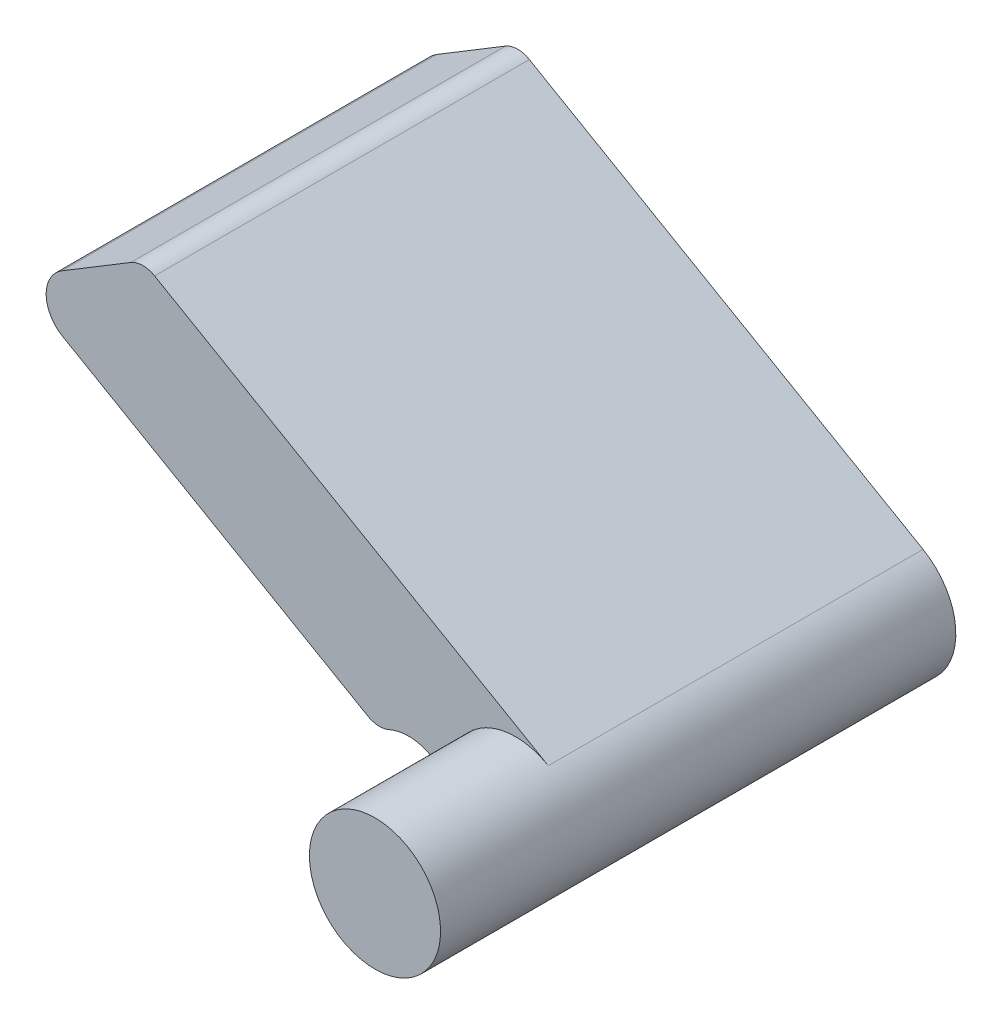
ISO-10303-21;
HEADER;
FILE_DESCRIPTION(('STEP AP214'),'2;1');
FILE_NAME('part.step','',(''),(''),'','','');
FILE_SCHEMA(('AUTOMOTIVE_DESIGN { 1 0 10303 214 1 1 1 1 }'));
ENDSEC;
DATA;
#1=APPLICATION_CONTEXT('core data for automotive mechanical design processes');
#2=APPLICATION_PROTOCOL_DEFINITION('international standard','automotive_design',2000,#1);
#3=PRODUCT_CONTEXT('',#1,'mechanical');
#4=PRODUCT('Part','Part','',(#3));
#5=PRODUCT_RELATED_PRODUCT_CATEGORY('part','',(#4));
#6=PRODUCT_DEFINITION_FORMATION('','',#4);
#7=PRODUCT_DEFINITION_CONTEXT('part definition',#1,'design');
#8=PRODUCT_DEFINITION('design','',#6,#7);
#9=PRODUCT_DEFINITION_SHAPE('','',#8);
#10=(LENGTH_UNIT() NAMED_UNIT(*) SI_UNIT(.MILLI.,.METRE.));
#11=(NAMED_UNIT(*) PLANE_ANGLE_UNIT() SI_UNIT($,.RADIAN.));
#12=(NAMED_UNIT(*) SI_UNIT($,.STERADIAN.) SOLID_ANGLE_UNIT());
#13=UNCERTAINTY_MEASURE_WITH_UNIT(LENGTH_MEASURE(1.E-05),#10,'distance_accuracy_value','');
#14=(GEOMETRIC_REPRESENTATION_CONTEXT(3) GLOBAL_UNCERTAINTY_ASSIGNED_CONTEXT((#13)) GLOBAL_UNIT_ASSIGNED_CONTEXT((#10,
#11,#12)) REPRESENTATION_CONTEXT('',''));
#15=CARTESIAN_POINT('',(0.,0.,0.));
#16=DIRECTION('',(0.,0.,1.));
#17=DIRECTION('',(1.,0.,0.));
#18=AXIS2_PLACEMENT_3D('',#15,#16,#17);
#19=CARTESIAN_POINT('',(-7.96025403784438,6.21243556529823,8.));
#20=DIRECTION('',(0.517785832846385,-0.855510275393333,0.));
#21=DIRECTION('',(0.855510275393333,0.517785832846385,0.));
#22=AXIS2_PLACEMENT_3D('',#19,#20,#21);
#23=PLANE('',#22);
#24=DIRECTION('',(-0.855510275393333,-0.517785832846385,0.));
#25=VECTOR('',#24,1.);
#26=CARTESIAN_POINT('',(-7.96025403784438,6.21243556529823,0.));
#27=LINE('',#26,#25);
#28=CARTESIAN_POINT('',(-8.21314633879446,6.05937597684656,0.));
#29=VERTEX_POINT('',#28);
#30=CARTESIAN_POINT('',(-9.68129055728227,5.17080187227626,0.));
#31=VERTEX_POINT('',#30);
#32=EDGE_CURVE('E172',#29,#31,#27,.T.);
#33=ORIENTED_EDGE('',*,*,#32,.T.);
#34=DIRECTION('',(0.,0.,-1.));
#35=VECTOR('',#34,1.);
#36=CARTESIAN_POINT('',(-9.68129055728227,5.17080187227626,8.));
#37=LINE('',#36,#35);
#38=CARTESIAN_POINT('',(-9.68129055728227,5.17080187227626,8.));
#39=VERTEX_POINT('',#38);
#40=EDGE_CURVE('E52',#31,#39,#37,.F.);
#41=ORIENTED_EDGE('',*,*,#40,.T.);
#42=DIRECTION('',(-0.855510275393333,-0.517785832846385,0.));
#43=VECTOR('',#42,1.);
#44=CARTESIAN_POINT('',(-7.96025403784438,6.21243556529823,8.));
#45=LINE('',#44,#43);
#46=CARTESIAN_POINT('',(-8.21314633879446,6.05937597684656,8.));
#47=VERTEX_POINT('',#46);
#48=EDGE_CURVE('E166',#47,#39,#45,.T.);
#49=ORIENTED_EDGE('',*,*,#48,.F.);
#50=DIRECTION('',(0.,0.,-1.));
#51=VECTOR('',#50,1.);
#52=CARTESIAN_POINT('',(-8.21314633879446,6.05937597684656,8.));
#53=LINE('',#52,#51);
#54=EDGE_CURVE('E128',#47,#29,#53,.T.);
#55=ORIENTED_EDGE('',*,*,#54,.T.);
#56=EDGE_LOOP('',(#33,#41,#49,#55));
#57=FACE_BOUND('',#56,.T.);
#58=ADVANCED_FACE('F35',(#57),#23,.F.);
#59=CARTESIAN_POINT('',(-10.6942286340599,4.55773502691897,8.));
#60=DIRECTION('',(0.500000000000001,0.866025403784438,0.));
#61=DIRECTION('',(-0.866025403784438,0.500000000000001,0.));
#62=AXIS2_PLACEMENT_3D('',#59,#60,#61);
#63=PLANE('',#62);
#64=DIRECTION('',(0.866025403784438,-0.500000000000001,0.));
#65=VECTOR('',#64,1.);
#66=CARTESIAN_POINT('',(-10.6942286340599,4.55773502691897,8.));
#67=LINE('',#66,#65);
#68=CARTESIAN_POINT('',(-9.66884047428981,3.96572689685182,8.));
#69=VERTEX_POINT('',#68);
#70=CARTESIAN_POINT('',(-3.15192630425893,0.203184746498805,8.));
#71=VERTEX_POINT('',#70);
#72=EDGE_CURVE('E123',#69,#71,#67,.T.);
#73=ORIENTED_EDGE('',*,*,#72,.F.);
#74=DIRECTION('',(0.,0.,-1.));
#75=VECTOR('',#74,1.);
#76=CARTESIAN_POINT('',(-9.66884047428981,3.96572689685182,8.));
#77=LINE('',#76,#75);
#78=CARTESIAN_POINT('',(-9.66884047428981,3.96572689685182,0.));
#79=VERTEX_POINT('',#78);
#80=EDGE_CURVE('E146',#69,#79,#77,.T.);
#81=ORIENTED_EDGE('',*,*,#80,.T.);
#82=DIRECTION('',(0.866025403784438,-0.500000000000001,0.));
#83=VECTOR('',#82,1.);
#84=CARTESIAN_POINT('',(-10.6942286340599,4.55773502691897,0.));
#85=LINE('',#84,#83);
#86=CARTESIAN_POINT('',(-3.15192630425893,0.203184746498805,0.));
#87=VERTEX_POINT('',#86);
#88=EDGE_CURVE('E170',#79,#87,#85,.T.);
#89=ORIENTED_EDGE('',*,*,#88,.T.);
#90=DIRECTION('',(0.,0.,-1.));
#91=VECTOR('',#90,1.);
#92=CARTESIAN_POINT('',(-3.15192630425893,0.203184746498805,8.));
#93=LINE('',#92,#91);
#94=EDGE_CURVE('E149',#87,#71,#93,.F.);
#95=ORIENTED_EDGE('',*,*,#94,.T.);
#96=EDGE_LOOP('',(#73,#81,#89,#95));
#97=FACE_BOUND('',#96,.T.);
#98=ADVANCED_FACE('F190',(#97),#63,.F.);
#99=CARTESIAN_POINT('',(-2.2858262526838,-0.731435808900241,8.));
#100=DIRECTION('',(0.,0.,-1.));
#101=DIRECTION('',(-1.,0.,0.));
#102=AXIS2_PLACEMENT_3D('',#99,#100,#101);
#103=CYLINDRICAL_SURFACE('',#102,1.);
#104=CARTESIAN_POINT('',(-2.2858262526838,-0.731435808900241,8.));
#105=DIRECTION('',(0.,0.,-1.));
#106=DIRECTION('',(-1.,0.,0.));
#107=AXIS2_PLACEMENT_3D('',#104,#105,#106);
#108=CIRCLE('',#107,1.);
#109=CARTESIAN_POINT('',(-2.69655962040056,0.180319695960603,8.));
#110=VERTEX_POINT('',#109);
#111=CARTESIAN_POINT('',(-1.33339864739889,-0.426670888525141,8.));
#112=VERTEX_POINT('',#111);
#113=EDGE_CURVE('E115',#110,#112,#108,.T.);
#114=ORIENTED_EDGE('',*,*,#113,.F.);
#115=DIRECTION('',(0.,0.,-1.));
#116=VECTOR('',#115,1.);
#117=CARTESIAN_POINT('',(-2.69655962040056,0.180319695960603,8.));
#118=LINE('',#117,#116);
#119=CARTESIAN_POINT('',(-2.69655962040056,0.180319695960603,0.));
#120=VERTEX_POINT('',#119);
#121=EDGE_CURVE('E152',#110,#120,#118,.T.);
#122=ORIENTED_EDGE('',*,*,#121,.T.);
#123=CARTESIAN_POINT('',(-2.2858262526838,-0.731435808900241,0.));
#124=DIRECTION('',(0.,0.,-1.));
#125=DIRECTION('',(-1.,0.,0.));
#126=AXIS2_PLACEMENT_3D('',#123,#124,#125);
#127=CIRCLE('',#126,1.);
#128=CARTESIAN_POINT('',(-1.33339864739889,-0.426670888525142,0.));
#129=VERTEX_POINT('',#128);
#130=EDGE_CURVE('E127',#120,#129,#127,.T.);
#131=ORIENTED_EDGE('',*,*,#130,.T.);
#132=DIRECTION('',(0.,0.,-1.));
#133=VECTOR('',#132,1.);
#134=CARTESIAN_POINT('',(-1.33339864739889,-0.426670888525142,8.));
#135=LINE('',#134,#133);
#136=EDGE_CURVE('E107',#112,#129,#135,.T.);
#137=ORIENTED_EDGE('',*,*,#136,.F.);
#138=EDGE_LOOP('',(#114,#122,#131,#137));
#139=FACE_BOUND('',#138,.T.);
#140=ADVANCED_FACE('F125',(#139),#103,.F.);
#141=CARTESIAN_POINT('',(0.,0.,8.));
#142=DIRECTION('',(0.,0.,-1.));
#143=DIRECTION('',(-1.,0.,0.));
#144=AXIS2_PLACEMENT_3D('',#141,#142,#143);
#145=CYLINDRICAL_SURFACE('',#144,1.4);
#146=CARTESIAN_POINT('',(0.,0.,0.));
#147=DIRECTION('',(0.,0.,1.));
#148=DIRECTION('',(1.,0.,0.));
#149=AXIS2_PLACEMENT_3D('',#146,#147,#148);
#150=CIRCLE('',#149,1.4);
#151=CARTESIAN_POINT('',(0.700000000000003,1.21243556529822,0.));
#152=VERTEX_POINT('',#151);
#153=EDGE_CURVE('E167',#129,#152,#150,.T.);
#154=ORIENTED_EDGE('',*,*,#153,.T.);
#155=DIRECTION('',(0.,0.,-1.));
#156=VECTOR('',#155,1.);
#157=CARTESIAN_POINT('',(0.700000000000003,1.21243556529822,8.));
#158=LINE('',#157,#156);
#159=CARTESIAN_POINT('',(0.700000000000003,1.21243556529822,8.));
#160=VERTEX_POINT('',#159);
#161=EDGE_CURVE('E110',#160,#152,#158,.T.);
#162=ORIENTED_EDGE('',*,*,#161,.F.);
#163=CARTESIAN_POINT('',(0.,0.,8.));
#164=DIRECTION('',(0.,0.,-1.));
#165=DIRECTION('',(-1.,0.,0.));
#166=AXIS2_PLACEMENT_3D('',#163,#164,#165);
#167=CIRCLE('',#166,1.4);
#168=EDGE_CURVE('E11',#112,#160,#167,.T.);
#169=ORIENTED_EDGE('',*,*,#168,.F.);
#170=ORIENTED_EDGE('',*,*,#136,.T.);
#171=EDGE_LOOP('',(#154,#162,#169,#170));
#172=FACE_BOUND('',#171,.T.);
#173=CARTESIAN_POINT('',(0.,0.,11.));
#174=DIRECTION('',(0.,0.,-1.));
#175=DIRECTION('',(-1.,0.,0.));
#176=AXIS2_PLACEMENT_3D('',#173,#174,#175);
#177=CIRCLE('',#176,1.4);
#178=CARTESIAN_POINT('',(-1.4,0.,11.));
#179=VERTEX_POINT('',#178);
#180=EDGE_CURVE('E174',#179,#179,#177,.T.);
#181=ORIENTED_EDGE('',*,*,#180,.T.);
#182=EDGE_LOOP('',(#181));
#183=FACE_BOUND('',#182,.T.);
#184=ADVANCED_FACE('F104',(#172,#183),#145,.T.);
#185=CARTESIAN_POINT('',(0.700000000000003,1.21243556529822,8.));
#186=DIRECTION('',(-0.500000000000001,-0.866025403784438,0.));
#187=DIRECTION('',(0.866025403784438,-0.500000000000001,0.));
#188=AXIS2_PLACEMENT_3D('',#185,#186,#187);
#189=PLANE('',#188);
#190=DIRECTION('',(-0.866025403784438,0.500000000000001,0.));
#191=VECTOR('',#190,1.);
#192=CARTESIAN_POINT('',(0.700000000000003,1.21243556529822,0.));
#193=LINE('',#192,#191);
#194=CARTESIAN_POINT('',(-7.70425342237126,6.06463354104211,0.));
#195=VERTEX_POINT('',#194);
#196=EDGE_CURVE('E163',#152,#195,#193,.T.);
#197=ORIENTED_EDGE('',*,*,#196,.T.);
#198=DIRECTION('',(0.,0.,-1.));
#199=VECTOR('',#198,1.);
#200=CARTESIAN_POINT('',(-7.70425342237126,6.06463354104211,8.));
#201=LINE('',#200,#199);
#202=CARTESIAN_POINT('',(-7.70425342237126,6.06463354104211,8.));
#203=VERTEX_POINT('',#202);
#204=EDGE_CURVE('E157',#195,#203,#201,.F.);
#205=ORIENTED_EDGE('',*,*,#204,.T.);
#206=DIRECTION('',(-0.866025403784438,0.500000000000001,0.));
#207=VECTOR('',#206,1.);
#208=CARTESIAN_POINT('',(0.700000000000003,1.21243556529822,8.));
#209=LINE('',#208,#207);
#210=EDGE_CURVE('E122',#160,#203,#209,.T.);
#211=ORIENTED_EDGE('',*,*,#210,.F.);
#212=ORIENTED_EDGE('',*,*,#161,.T.);
#213=EDGE_LOOP('',(#197,#205,#211,#212));
#214=FACE_BOUND('',#213,.T.);
#215=ADVANCED_FACE('F210',(#214),#189,.F.);
#216=CARTESIAN_POINT('',(-2.2858262526838,-0.731435808900241,8.));
#217=DIRECTION('',(0.,0.,-1.));
#218=DIRECTION('',(-1.,0.,0.));
#219=AXIS2_PLACEMENT_3D('',#216,#217,#218);
#220=PLANE('',#219);
#221=ORIENTED_EDGE('',*,*,#113,.T.);
#222=ORIENTED_EDGE('',*,*,#168,.T.);
#223=ORIENTED_EDGE('',*,*,#210,.T.);
#224=CARTESIAN_POINT('',(-7.95425342237126,5.63162083914989,8.));
#225=DIRECTION('',(0.,0.,-1.));
#226=DIRECTION('',(-1.,0.,0.));
#227=AXIS2_PLACEMENT_3D('',#224,#225,#226);
#228=CIRCLE('',#227,0.5);
#229=EDGE_CURVE('E154',#203,#47,#228,.F.);
#230=ORIENTED_EDGE('',*,*,#229,.T.);
#231=ORIENTED_EDGE('',*,*,#48,.T.);
#232=CARTESIAN_POINT('',(-9.3188404742898,4.57194467950093,8.));
#233=DIRECTION('',(0.,0.,-1.));
#234=DIRECTION('',(-1.,0.,0.));
#235=AXIS2_PLACEMENT_3D('',#232,#233,#234);
#236=CIRCLE('',#235,0.7);
#237=EDGE_CURVE('E44',#39,#69,#236,.F.);
#238=ORIENTED_EDGE('',*,*,#237,.T.);
#239=ORIENTED_EDGE('',*,*,#72,.T.);
#240=CARTESIAN_POINT('',(-2.90192630425893,0.636197448391024,8.));
#241=DIRECTION('',(0.,0.,-1.));
#242=DIRECTION('',(-1.,0.,0.));
#243=AXIS2_PLACEMENT_3D('',#240,#241,#242);
#244=CIRCLE('',#243,0.5);
#245=EDGE_CURVE('E118',#71,#110,#244,.F.);
#246=ORIENTED_EDGE('',*,*,#245,.T.);
#247=EDGE_LOOP('',(#221,#222,#223,#230,#231,#238,#239,#246));
#248=FACE_BOUND('',#247,.T.);
#249=ADVANCED_FACE('F116',(#248),#220,.F.);
#250=CARTESIAN_POINT('',(-2.2858262526838,-0.731435808900241,0.));
#251=DIRECTION('',(0.,0.,-1.));
#252=DIRECTION('',(-1.,0.,0.));
#253=AXIS2_PLACEMENT_3D('',#250,#251,#252);
#254=PLANE('',#253);
#255=ORIENTED_EDGE('',*,*,#88,.F.);
#256=CARTESIAN_POINT('',(-9.3188404742898,4.57194467950093,0.));
#257=DIRECTION('',(0.,0.,-1.));
#258=DIRECTION('',(-1.,0.,0.));
#259=AXIS2_PLACEMENT_3D('',#256,#257,#258);
#260=CIRCLE('',#259,0.7);
#261=EDGE_CURVE('E60',#79,#31,#260,.T.);
#262=ORIENTED_EDGE('',*,*,#261,.T.);
#263=ORIENTED_EDGE('',*,*,#32,.F.);
#264=CARTESIAN_POINT('',(-7.95425342237126,5.63162083914989,0.));
#265=DIRECTION('',(0.,0.,-1.));
#266=DIRECTION('',(-1.,0.,0.));
#267=AXIS2_PLACEMENT_3D('',#264,#265,#266);
#268=CIRCLE('',#267,0.5);
#269=EDGE_CURVE('E159',#29,#195,#268,.T.);
#270=ORIENTED_EDGE('',*,*,#269,.T.);
#271=ORIENTED_EDGE('',*,*,#196,.F.);
#272=ORIENTED_EDGE('',*,*,#153,.F.);
#273=ORIENTED_EDGE('',*,*,#130,.F.);
#274=CARTESIAN_POINT('',(-2.90192630425893,0.636197448391024,0.));
#275=DIRECTION('',(0.,0.,-1.));
#276=DIRECTION('',(-1.,0.,0.));
#277=AXIS2_PLACEMENT_3D('',#274,#275,#276);
#278=CIRCLE('',#277,0.5);
#279=EDGE_CURVE('E130',#120,#87,#278,.T.);
#280=ORIENTED_EDGE('',*,*,#279,.T.);
#281=EDGE_LOOP('',(#255,#262,#263,#270,#271,#272,#273,#280));
#282=FACE_BOUND('',#281,.T.);
#283=ADVANCED_FACE('F201',(#282),#254,.T.);
#284=CARTESIAN_POINT('',(-7.95425342237126,5.63162083914989,8.));
#285=DIRECTION('',(0.,0.,-1.));
#286=DIRECTION('',(-1.,0.,0.));
#287=AXIS2_PLACEMENT_3D('',#284,#285,#286);
#288=CYLINDRICAL_SURFACE('',#287,0.5);
#289=ORIENTED_EDGE('',*,*,#229,.F.);
#290=ORIENTED_EDGE('',*,*,#204,.F.);
#291=ORIENTED_EDGE('',*,*,#269,.F.);
#292=ORIENTED_EDGE('',*,*,#54,.F.);
#293=EDGE_LOOP('',(#289,#290,#291,#292));
#294=FACE_BOUND('',#293,.T.);
#295=ADVANCED_FACE('F199',(#294),#288,.T.);
#296=CARTESIAN_POINT('',(-2.90192630425893,0.636197448391024,8.));
#297=DIRECTION('',(0.,0.,-1.));
#298=DIRECTION('',(-1.,0.,0.));
#299=AXIS2_PLACEMENT_3D('',#296,#297,#298);
#300=CYLINDRICAL_SURFACE('',#299,0.5);
#301=ORIENTED_EDGE('',*,*,#245,.F.);
#302=ORIENTED_EDGE('',*,*,#94,.F.);
#303=ORIENTED_EDGE('',*,*,#279,.F.);
#304=ORIENTED_EDGE('',*,*,#121,.F.);
#305=EDGE_LOOP('',(#301,#302,#303,#304));
#306=FACE_BOUND('',#305,.T.);
#307=ADVANCED_FACE('F186',(#306),#300,.T.);
#308=CARTESIAN_POINT('',(-9.3188404742898,4.57194467950093,8.));
#309=DIRECTION('',(0.,0.,-1.));
#310=DIRECTION('',(-1.,0.,0.));
#311=AXIS2_PLACEMENT_3D('',#308,#309,#310);
#312=CYLINDRICAL_SURFACE('',#311,0.7);
#313=ORIENTED_EDGE('',*,*,#237,.F.);
#314=ORIENTED_EDGE('',*,*,#40,.F.);
#315=ORIENTED_EDGE('',*,*,#261,.F.);
#316=ORIENTED_EDGE('',*,*,#80,.F.);
#317=EDGE_LOOP('',(#313,#314,#315,#316));
#318=FACE_BOUND('',#317,.T.);
#319=ADVANCED_FACE('F37',(#318),#312,.T.);
#320=CARTESIAN_POINT('',(0.,0.,11.));
#321=DIRECTION('',(0.,0.,-1.));
#322=DIRECTION('',(-1.,0.,0.));
#323=AXIS2_PLACEMENT_3D('',#320,#321,#322);
#324=PLANE('',#323);
#325=ORIENTED_EDGE('',*,*,#180,.F.);
#326=EDGE_LOOP('',(#325));
#327=FACE_BOUND('',#326,.T.);
#328=ADVANCED_FACE('F180',(#327),#324,.F.);
#329=CLOSED_SHELL('',(#58,#98,#140,#184,#215,#249,#283,#295,#307,#319,#328));
#330=MANIFOLD_SOLID_BREP('B2',#329);
#331=ADVANCED_BREP_SHAPE_REPRESENTATION('',(#18,#330),#14);
#332=SHAPE_DEFINITION_REPRESENTATION(#9,#331);
ENDSEC;
END-ISO-10303-21;
